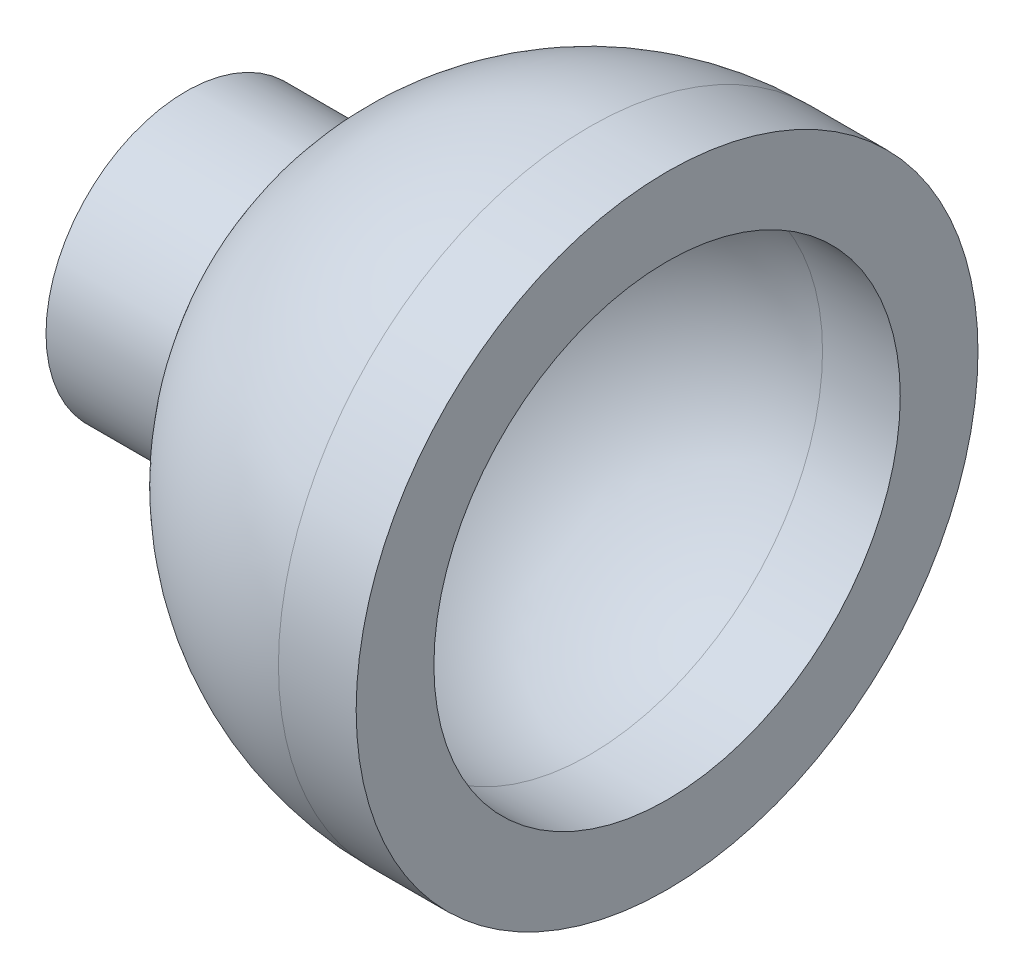
ISO-10303-21;
HEADER;
FILE_DESCRIPTION(('STEP AP214'),'2;1');
FILE_NAME('part.step','',(''),(''),'','','');
FILE_SCHEMA(('AUTOMOTIVE_DESIGN { 1 0 10303 214 1 1 1 1 }'));
ENDSEC;
DATA;
#1=APPLICATION_CONTEXT('core data for automotive mechanical design processes');
#2=APPLICATION_PROTOCOL_DEFINITION('international standard','automotive_design',2000,#1);
#3=PRODUCT_CONTEXT('',#1,'mechanical');
#4=PRODUCT('Part','Part','',(#3));
#5=PRODUCT_RELATED_PRODUCT_CATEGORY('part','',(#4));
#6=PRODUCT_DEFINITION_FORMATION('','',#4);
#7=PRODUCT_DEFINITION_CONTEXT('part definition',#1,'design');
#8=PRODUCT_DEFINITION('design','',#6,#7);
#9=PRODUCT_DEFINITION_SHAPE('','',#8);
#10=(LENGTH_UNIT() NAMED_UNIT(*) SI_UNIT(.MILLI.,.METRE.));
#11=(NAMED_UNIT(*) PLANE_ANGLE_UNIT() SI_UNIT($,.RADIAN.));
#12=(NAMED_UNIT(*) SI_UNIT($,.STERADIAN.) SOLID_ANGLE_UNIT());
#13=UNCERTAINTY_MEASURE_WITH_UNIT(LENGTH_MEASURE(1.E-05),#10,'distance_accuracy_value','');
#14=(GEOMETRIC_REPRESENTATION_CONTEXT(3) GLOBAL_UNCERTAINTY_ASSIGNED_CONTEXT((#13)) GLOBAL_UNIT_ASSIGNED_CONTEXT((#10,
#11,#12)) REPRESENTATION_CONTEXT('',''));
#15=CARTESIAN_POINT('',(0.,0.,0.));
#16=DIRECTION('',(0.,0.,1.));
#17=DIRECTION('',(1.,0.,0.));
#18=AXIS2_PLACEMENT_3D('',#15,#16,#17);
#19=CARTESIAN_POINT('',(-10.3803176832115,1.6,0.));
#20=DIRECTION('',(1.,0.,0.));
#21=DIRECTION('',(0.,0.,-1.));
#22=AXIS2_PLACEMENT_3D('',#19,#20,#21);
#23=PLANE('',#22);
#24=CARTESIAN_POINT('',(-10.3803176832115,0.,0.));
#25=DIRECTION('',(-1.,0.,0.));
#26=DIRECTION('',(0.,0.,1.));
#27=AXIS2_PLACEMENT_3D('',#24,#25,#26);
#28=CIRCLE('',#27,1.6);
#29=CARTESIAN_POINT('',(-10.3803176832115,0.,1.6));
#30=VERTEX_POINT('',#29);
#31=EDGE_CURVE('E10',#30,#30,#28,.T.);
#32=ORIENTED_EDGE('',*,*,#31,.F.);
#33=EDGE_LOOP('',(#32));
#34=FACE_BOUND('',#33,.T.);
#35=CARTESIAN_POINT('',(-10.3803176832115,0.,0.));
#36=DIRECTION('',(-1.,0.,0.));
#37=DIRECTION('',(0.,0.,1.));
#38=AXIS2_PLACEMENT_3D('',#35,#36,#37);
#39=CIRCLE('',#38,3.6);
#40=CARTESIAN_POINT('',(-10.3803176832115,0.,3.6));
#41=VERTEX_POINT('',#40);
#42=EDGE_CURVE('E74',#41,#41,#39,.T.);
#43=ORIENTED_EDGE('',*,*,#42,.T.);
#44=EDGE_LOOP('',(#43));
#45=FACE_BOUND('',#44,.T.);
#46=ADVANCED_FACE('F39',(#34,#45),#23,.F.);
#47=CARTESIAN_POINT('',(-14.8397258525542,0.,0.));
#48=DIRECTION('',(-1.,0.,0.));
#49=DIRECTION('',(0.,0.,1.));
#50=AXIS2_PLACEMENT_3D('',#47,#48,#49);
#51=CYLINDRICAL_SURFACE('',#50,1.6);
#52=CARTESIAN_POINT('',(-5.78273291792038,0.,0.));
#53=DIRECTION('',(-1.,0.,0.));
#54=DIRECTION('',(0.,0.,1.));
#55=AXIS2_PLACEMENT_3D('',#52,#53,#54);
#56=CIRCLE('',#55,1.6);
#57=CARTESIAN_POINT('',(-5.78273291792038,0.,1.6));
#58=VERTEX_POINT('',#57);
#59=EDGE_CURVE('E46',#58,#58,#56,.T.);
#60=ORIENTED_EDGE('',*,*,#59,.F.);
#61=EDGE_LOOP('',(#60));
#62=FACE_BOUND('',#61,.T.);
#63=ORIENTED_EDGE('',*,*,#31,.T.);
#64=EDGE_LOOP('',(#63));
#65=FACE_BOUND('',#64,.T.);
#66=ADVANCED_FACE('F112',(#62,#65),#51,.F.);
#67=CARTESIAN_POINT('',(0.,0.,0.));
#68=DIRECTION('',(-1.,0.,0.));
#69=DIRECTION('',(0.,1.,0.));
#70=AXIS2_PLACEMENT_3D('',#67,#68,#69);
#71=SPHERICAL_SURFACE('',#70,6.);
#72=CARTESIAN_POINT('',(0.,0.,0.));
#73=DIRECTION('',(-1.,0.,0.));
#74=DIRECTION('',(0.,0.,1.));
#75=AXIS2_PLACEMENT_3D('',#72,#73,#74);
#76=CIRCLE('',#75,6.);
#77=CARTESIAN_POINT('',(0.,0.,6.));
#78=VERTEX_POINT('',#77);
#79=EDGE_CURVE('E51',#78,#78,#76,.T.);
#80=ORIENTED_EDGE('',*,*,#79,.F.);
#81=EDGE_LOOP('',(#80));
#82=FACE_BOUND('',#81,.T.);
#83=ORIENTED_EDGE('',*,*,#59,.T.);
#84=EDGE_LOOP('',(#83));
#85=FACE_BOUND('',#84,.T.);
#86=ADVANCED_FACE('F107',(#82,#85),#71,.F.);
#87=CARTESIAN_POINT('',(-14.8397258525542,0.,0.));
#88=DIRECTION('',(-1.,0.,0.));
#89=DIRECTION('',(0.,0.,1.));
#90=AXIS2_PLACEMENT_3D('',#87,#88,#89);
#91=CYLINDRICAL_SURFACE('',#90,6.);
#92=CARTESIAN_POINT('',(2.,0.,0.));
#93=DIRECTION('',(-1.,0.,0.));
#94=DIRECTION('',(0.,0.,1.));
#95=AXIS2_PLACEMENT_3D('',#92,#93,#94);
#96=CIRCLE('',#95,6.);
#97=CARTESIAN_POINT('',(2.,0.,6.));
#98=VERTEX_POINT('',#97);
#99=EDGE_CURVE('E56',#98,#98,#96,.T.);
#100=ORIENTED_EDGE('',*,*,#99,.F.);
#101=EDGE_LOOP('',(#100));
#102=FACE_BOUND('',#101,.T.);
#103=ORIENTED_EDGE('',*,*,#79,.T.);
#104=EDGE_LOOP('',(#103));
#105=FACE_BOUND('',#104,.T.);
#106=ADVANCED_FACE('F101',(#102,#105),#91,.F.);
#107=CARTESIAN_POINT('',(2.,8.,0.));
#108=DIRECTION('',(-1.,0.,0.));
#109=DIRECTION('',(0.,0.,1.));
#110=AXIS2_PLACEMENT_3D('',#107,#108,#109);
#111=PLANE('',#110);
#112=CARTESIAN_POINT('',(2.,0.,0.));
#113=DIRECTION('',(-1.,0.,0.));
#114=DIRECTION('',(0.,0.,1.));
#115=AXIS2_PLACEMENT_3D('',#112,#113,#114);
#116=CIRCLE('',#115,8.);
#117=CARTESIAN_POINT('',(2.,0.,8.));
#118=VERTEX_POINT('',#117);
#119=EDGE_CURVE('E62',#118,#118,#116,.T.);
#120=ORIENTED_EDGE('',*,*,#119,.F.);
#121=EDGE_LOOP('',(#120));
#122=FACE_BOUND('',#121,.T.);
#123=ORIENTED_EDGE('',*,*,#99,.T.);
#124=EDGE_LOOP('',(#123));
#125=FACE_BOUND('',#124,.T.);
#126=ADVANCED_FACE('F95',(#122,#125),#111,.F.);
#127=CARTESIAN_POINT('',(-14.8397258525542,0.,0.));
#128=DIRECTION('',(-1.,0.,0.));
#129=DIRECTION('',(0.,0.,1.));
#130=AXIS2_PLACEMENT_3D('',#127,#128,#129);
#131=CYLINDRICAL_SURFACE('',#130,8.);
#132=CARTESIAN_POINT('',(0.,0.,0.));
#133=DIRECTION('',(-1.,0.,0.));
#134=DIRECTION('',(0.,0.,1.));
#135=AXIS2_PLACEMENT_3D('',#132,#133,#134);
#136=CIRCLE('',#135,8.);
#137=CARTESIAN_POINT('',(0.,0.,8.));
#138=VERTEX_POINT('',#137);
#139=EDGE_CURVE('E66',#138,#138,#136,.T.);
#140=ORIENTED_EDGE('',*,*,#139,.F.);
#141=EDGE_LOOP('',(#140));
#142=FACE_BOUND('',#141,.T.);
#143=ORIENTED_EDGE('',*,*,#119,.T.);
#144=EDGE_LOOP('',(#143));
#145=FACE_BOUND('',#144,.T.);
#146=ADVANCED_FACE('F89',(#142,#145),#131,.T.);
#147=CARTESIAN_POINT('',(0.,0.,0.));
#148=DIRECTION('',(-1.,0.,0.));
#149=DIRECTION('',(0.,1.,0.));
#150=AXIS2_PLACEMENT_3D('',#147,#148,#149);
#151=SPHERICAL_SURFACE('',#150,8.);
#152=CARTESIAN_POINT('',(-7.1442284397967,0.,0.));
#153=DIRECTION('',(-1.,0.,0.));
#154=DIRECTION('',(0.,0.,1.));
#155=AXIS2_PLACEMENT_3D('',#152,#153,#154);
#156=CIRCLE('',#155,3.6);
#157=CARTESIAN_POINT('',(-7.1442284397967,0.,3.6));
#158=VERTEX_POINT('',#157);
#159=EDGE_CURVE('E70',#158,#158,#156,.T.);
#160=ORIENTED_EDGE('',*,*,#159,.F.);
#161=EDGE_LOOP('',(#160));
#162=FACE_BOUND('',#161,.T.);
#163=ORIENTED_EDGE('',*,*,#139,.T.);
#164=EDGE_LOOP('',(#163));
#165=FACE_BOUND('',#164,.T.);
#166=ADVANCED_FACE('F83',(#162,#165),#151,.T.);
#167=CARTESIAN_POINT('',(-14.8397258525542,0.,0.));
#168=DIRECTION('',(-1.,0.,0.));
#169=DIRECTION('',(0.,0.,1.));
#170=AXIS2_PLACEMENT_3D('',#167,#168,#169);
#171=CYLINDRICAL_SURFACE('',#170,3.6);
#172=ORIENTED_EDGE('',*,*,#42,.F.);
#173=EDGE_LOOP('',(#172));
#174=FACE_BOUND('',#173,.T.);
#175=ORIENTED_EDGE('',*,*,#159,.T.);
#176=EDGE_LOOP('',(#175));
#177=FACE_BOUND('',#176,.T.);
#178=ADVANCED_FACE('F80',(#174,#177),#171,.T.);
#179=CLOSED_SHELL('',(#46,#66,#86,#106,#126,#146,#166,#178));
#180=MANIFOLD_SOLID_BREP('B2',#179);
#181=ADVANCED_BREP_SHAPE_REPRESENTATION('',(#18,#180),#14);
#182=SHAPE_DEFINITION_REPRESENTATION(#9,#181);
ENDSEC;
END-ISO-10303-21;
